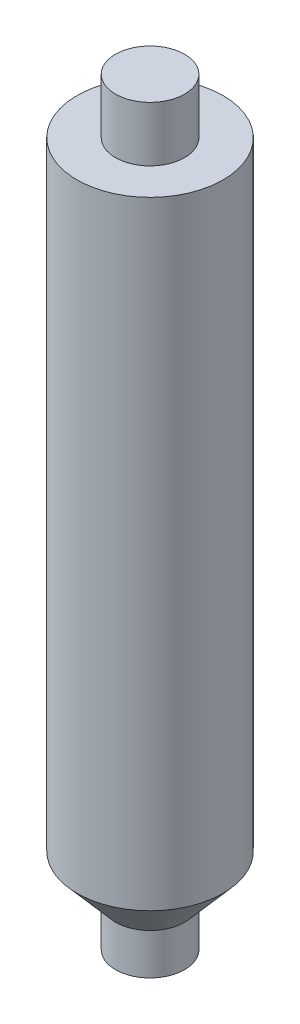
ISO-10303-21;
HEADER;
FILE_DESCRIPTION(('STEP AP214'),'2;1');
FILE_NAME('part.step','',(''),(''),'','','');
FILE_SCHEMA(('AUTOMOTIVE_DESIGN { 1 0 10303 214 1 1 1 1 }'));
ENDSEC;
DATA;
#1=APPLICATION_CONTEXT('core data for automotive mechanical design processes');
#2=APPLICATION_PROTOCOL_DEFINITION('international standard','automotive_design',2000,#1);
#3=PRODUCT_CONTEXT('',#1,'mechanical');
#4=PRODUCT('Part','Part','',(#3));
#5=PRODUCT_RELATED_PRODUCT_CATEGORY('part','',(#4));
#6=PRODUCT_DEFINITION_FORMATION('','',#4);
#7=PRODUCT_DEFINITION_CONTEXT('part definition',#1,'design');
#8=PRODUCT_DEFINITION('design','',#6,#7);
#9=PRODUCT_DEFINITION_SHAPE('','',#8);
#10=(LENGTH_UNIT() NAMED_UNIT(*) SI_UNIT(.MILLI.,.METRE.));
#11=(NAMED_UNIT(*) PLANE_ANGLE_UNIT() SI_UNIT($,.RADIAN.));
#12=(NAMED_UNIT(*) SI_UNIT($,.STERADIAN.) SOLID_ANGLE_UNIT());
#13=UNCERTAINTY_MEASURE_WITH_UNIT(LENGTH_MEASURE(1.E-05),#10,'distance_accuracy_value','');
#14=(GEOMETRIC_REPRESENTATION_CONTEXT(3) GLOBAL_UNCERTAINTY_ASSIGNED_CONTEXT((#13)) GLOBAL_UNIT_ASSIGNED_CONTEXT((#10,
#11,#12)) REPRESENTATION_CONTEXT('',''));
#15=CARTESIAN_POINT('',(0.,0.,0.));
#16=DIRECTION('',(0.,0.,1.));
#17=DIRECTION('',(1.,0.,0.));
#18=AXIS2_PLACEMENT_3D('',#15,#16,#17);
#19=CARTESIAN_POINT('',(3.18883881437436,0.,0.));
#20=DIRECTION('',(0.,-1.,0.));
#21=DIRECTION('',(0.,0.,-1.));
#22=AXIS2_PLACEMENT_3D('',#19,#20,#21);
#23=PLANE('',#22);
#24=CARTESIAN_POINT('',(0.,0.,0.));
#25=DIRECTION('',(0.,-1.,0.));
#26=DIRECTION('',(0.,0.,-1.));
#27=AXIS2_PLACEMENT_3D('',#24,#25,#26);
#28=CIRCLE('',#27,3.18883881437436);
#29=CARTESIAN_POINT('',(0.,0.,-3.18883881437436));
#30=VERTEX_POINT('',#29);
#31=EDGE_CURVE('E70',#30,#30,#28,.T.);
#32=ORIENTED_EDGE('',*,*,#31,.T.);
#33=EDGE_LOOP('',(#32));
#34=FACE_BOUND('',#33,.T.);
#35=ADVANCED_FACE('F43',(#34),#23,.T.);
#36=CARTESIAN_POINT('',(0.,70.0000124,0.));
#37=DIRECTION('',(0.,1.,0.));
#38=DIRECTION('',(0.,0.,1.));
#39=AXIS2_PLACEMENT_3D('',#36,#37,#38);
#40=PLANE('',#39);
#41=CARTESIAN_POINT('',(0.,70.0000124,0.));
#42=DIRECTION('',(0.,-1.,0.));
#43=DIRECTION('',(0.,0.,-1.));
#44=AXIS2_PLACEMENT_3D('',#41,#42,#43);
#45=CIRCLE('',#44,3.18883881437435);
#46=CARTESIAN_POINT('',(0.,70.0000124,-3.18883881437435));
#47=VERTEX_POINT('',#46);
#48=EDGE_CURVE('E10',#47,#47,#45,.T.);
#49=ORIENTED_EDGE('',*,*,#48,.F.);
#50=EDGE_LOOP('',(#49));
#51=FACE_BOUND('',#50,.T.);
#52=ADVANCED_FACE('F88',(#51),#40,.T.);
#53=CARTESIAN_POINT('',(0.,0.,0.));
#54=DIRECTION('',(0.,-1.,0.));
#55=DIRECTION('',(0.,0.,-1.));
#56=AXIS2_PLACEMENT_3D('',#53,#54,#55);
#57=CYLINDRICAL_SURFACE('',#56,3.18883881437435);
#58=ORIENTED_EDGE('',*,*,#48,.T.);
#59=EDGE_LOOP('',(#58));
#60=FACE_BOUND('',#59,.T.);
#61=CARTESIAN_POINT('',(0.,64.9200124,0.));
#62=DIRECTION('',(0.,-1.,0.));
#63=DIRECTION('',(0.,0.,-1.));
#64=AXIS2_PLACEMENT_3D('',#61,#62,#63);
#65=CIRCLE('',#64,3.18883881437435);
#66=CARTESIAN_POINT('',(0.,64.9200124,-3.18883881437435));
#67=VERTEX_POINT('',#66);
#68=EDGE_CURVE('E50',#67,#67,#65,.T.);
#69=ORIENTED_EDGE('',*,*,#68,.F.);
#70=EDGE_LOOP('',(#69));
#71=FACE_BOUND('',#70,.T.);
#72=ADVANCED_FACE('F92',(#60,#71),#57,.T.);
#73=CARTESIAN_POINT('',(6.7437,64.9200124,0.));
#74=DIRECTION('',(0.,1.,0.));
#75=DIRECTION('',(0.,0.,1.));
#76=AXIS2_PLACEMENT_3D('',#73,#74,#75);
#77=PLANE('',#76);
#78=ORIENTED_EDGE('',*,*,#68,.T.);
#79=EDGE_LOOP('',(#78));
#80=FACE_BOUND('',#79,.T.);
#81=CARTESIAN_POINT('',(0.,64.9200124,0.));
#82=DIRECTION('',(0.,-1.,0.));
#83=DIRECTION('',(0.,0.,-1.));
#84=AXIS2_PLACEMENT_3D('',#81,#82,#83);
#85=CIRCLE('',#84,6.7437);
#86=CARTESIAN_POINT('',(0.,64.9200124,-6.7437));
#87=VERTEX_POINT('',#86);
#88=EDGE_CURVE('E55',#87,#87,#85,.T.);
#89=ORIENTED_EDGE('',*,*,#88,.F.);
#90=EDGE_LOOP('',(#89));
#91=FACE_BOUND('',#90,.T.);
#92=ADVANCED_FACE('F97',(#80,#91),#77,.T.);
#93=CARTESIAN_POINT('',(0.,0.,0.));
#94=DIRECTION('',(0.,-1.,0.));
#95=DIRECTION('',(0.,0.,-1.));
#96=AXIS2_PLACEMENT_3D('',#93,#94,#95);
#97=CYLINDRICAL_SURFACE('',#96,6.7437);
#98=ORIENTED_EDGE('',*,*,#88,.T.);
#99=EDGE_LOOP('',(#98));
#100=FACE_BOUND('',#99,.T.);
#101=CARTESIAN_POINT('',(0.,7.8840112765726,0.));
#102=DIRECTION('',(0.,-1.,0.));
#103=DIRECTION('',(0.,0.,-1.));
#104=AXIS2_PLACEMENT_3D('',#101,#102,#103);
#105=CIRCLE('',#104,6.7437);
#106=CARTESIAN_POINT('',(0.,7.8840112765726,-6.7437));
#107=VERTEX_POINT('',#106);
#108=EDGE_CURVE('E60',#107,#107,#105,.T.);
#109=ORIENTED_EDGE('',*,*,#108,.F.);
#110=EDGE_LOOP('',(#109));
#111=FACE_BOUND('',#110,.T.);
#112=ADVANCED_FACE('F84',(#100,#111),#97,.T.);
#113=CARTESIAN_POINT('',(0.,3.7946112765726,0.));
#114=DIRECTION('',(0.,1.,0.));
#115=DIRECTION('',(0.,0.,1.));
#116=AXIS2_PLACEMENT_3D('',#113,#114,#115);
#117=CONICAL_SURFACE('',#116,3.18883881437436,0.715584993317669);
#118=ORIENTED_EDGE('',*,*,#108,.T.);
#119=EDGE_LOOP('',(#118));
#120=FACE_BOUND('',#119,.T.);
#121=CARTESIAN_POINT('',(0.,3.7946112765726,0.));
#122=DIRECTION('',(0.,-1.,0.));
#123=DIRECTION('',(0.,0.,-1.));
#124=AXIS2_PLACEMENT_3D('',#121,#122,#123);
#125=CIRCLE('',#124,3.18883881437436);
#126=CARTESIAN_POINT('',(0.,3.7946112765726,-3.18883881437436));
#127=VERTEX_POINT('',#126);
#128=EDGE_CURVE('E66',#127,#127,#125,.T.);
#129=ORIENTED_EDGE('',*,*,#128,.F.);
#130=EDGE_LOOP('',(#129));
#131=FACE_BOUND('',#130,.T.);
#132=ADVANCED_FACE('F78',(#120,#131),#117,.T.);
#133=CARTESIAN_POINT('',(0.,0.,0.));
#134=DIRECTION('',(0.,-1.,0.));
#135=DIRECTION('',(0.,0.,-1.));
#136=AXIS2_PLACEMENT_3D('',#133,#134,#135);
#137=CYLINDRICAL_SURFACE('',#136,3.18883881437436);
#138=ORIENTED_EDGE('',*,*,#128,.T.);
#139=EDGE_LOOP('',(#138));
#140=FACE_BOUND('',#139,.T.);
#141=ORIENTED_EDGE('',*,*,#31,.F.);
#142=EDGE_LOOP('',(#141));
#143=FACE_BOUND('',#142,.T.);
#144=ADVANCED_FACE('F76',(#140,#143),#137,.T.);
#145=CLOSED_SHELL('',(#35,#52,#72,#92,#112,#132,#144));
#146=MANIFOLD_SOLID_BREP('B2',#145);
#147=ADVANCED_BREP_SHAPE_REPRESENTATION('',(#18,#146),#14);
#148=SHAPE_DEFINITION_REPRESENTATION(#9,#147);
ENDSEC;
END-ISO-10303-21;
